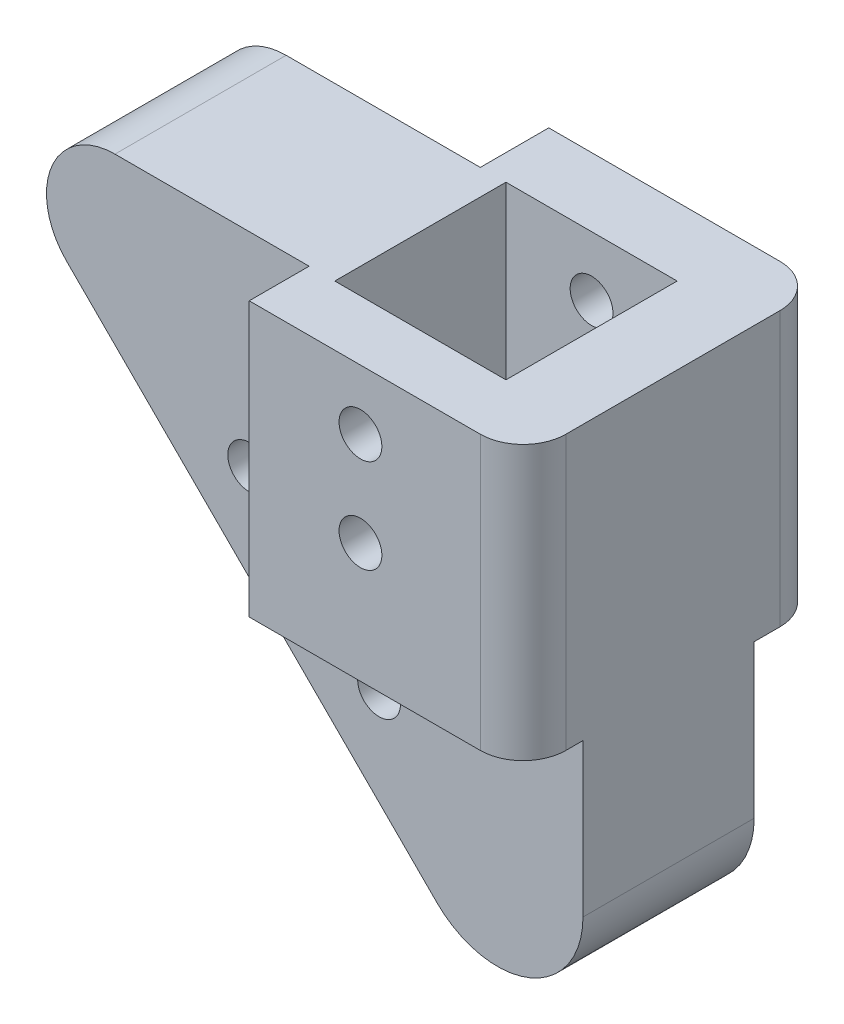
ISO-10303-21;
HEADER;
FILE_DESCRIPTION(('STEP AP214'),'2;1');
FILE_NAME('part.step','',(''),(''),'','','');
FILE_SCHEMA(('AUTOMOTIVE_DESIGN { 1 0 10303 214 1 1 1 1 }'));
ENDSEC;
DATA;
#1=APPLICATION_CONTEXT('core data for automotive mechanical design processes');
#2=APPLICATION_PROTOCOL_DEFINITION('international standard','automotive_design',2000,#1);
#3=PRODUCT_CONTEXT('',#1,'mechanical');
#4=PRODUCT('Part','Part','',(#3));
#5=PRODUCT_RELATED_PRODUCT_CATEGORY('part','',(#4));
#6=PRODUCT_DEFINITION_FORMATION('','',#4);
#7=PRODUCT_DEFINITION_CONTEXT('part definition',#1,'design');
#8=PRODUCT_DEFINITION('design','',#6,#7);
#9=PRODUCT_DEFINITION_SHAPE('','',#8);
#10=(LENGTH_UNIT() NAMED_UNIT(*) SI_UNIT(.MILLI.,.METRE.));
#11=(NAMED_UNIT(*) PLANE_ANGLE_UNIT() SI_UNIT($,.RADIAN.));
#12=(NAMED_UNIT(*) SI_UNIT($,.STERADIAN.) SOLID_ANGLE_UNIT());
#13=UNCERTAINTY_MEASURE_WITH_UNIT(LENGTH_MEASURE(1.E-05),#10,'distance_accuracy_value','');
#14=(GEOMETRIC_REPRESENTATION_CONTEXT(3) GLOBAL_UNCERTAINTY_ASSIGNED_CONTEXT((#13)) GLOBAL_UNIT_ASSIGNED_CONTEXT((#10,
#11,#12)) REPRESENTATION_CONTEXT('',''));
#15=CARTESIAN_POINT('',(0.,0.,0.));
#16=DIRECTION('',(0.,0.,1.));
#17=DIRECTION('',(1.,0.,0.));
#18=AXIS2_PLACEMENT_3D('',#15,#16,#17);
#19=CARTESIAN_POINT('',(0.,0.,0.));
#20=DIRECTION('',(0.,0.,1.));
#21=DIRECTION('',(1.,0.,0.));
#22=AXIS2_PLACEMENT_3D('',#19,#20,#21);
#23=PLANE('',#22);
#24=CARTESIAN_POINT('',(1.37412982933484,-20.8727925216274,0.));
#25=DIRECTION('',(0.,0.,1.));
#26=DIRECTION('',(1.,0.,0.));
#27=AXIS2_PLACEMENT_3D('',#24,#25,#26);
#28=CIRCLE('',#27,2.5);
#29=CARTESIAN_POINT('',(3.87412982933484,-20.8727925216274,0.));
#30=VERTEX_POINT('',#29);
#31=EDGE_CURVE('E431',#30,#30,#28,.T.);
#32=ORIENTED_EDGE('',*,*,#31,.T.);
#33=EDGE_LOOP('',(#32));
#34=FACE_BOUND('',#33,.T.);
#35=CARTESIAN_POINT('',(-13.798157313412,-5.70050537888049,0.));
#36=DIRECTION('',(0.,0.,1.));
#37=DIRECTION('',(1.,0.,0.));
#38=AXIS2_PLACEMENT_3D('',#35,#36,#37);
#39=CIRCLE('',#38,2.5);
#40=CARTESIAN_POINT('',(-11.298157313412,-5.70050537888049,0.));
#41=VERTEX_POINT('',#40);
#42=EDGE_CURVE('E430',#41,#41,#39,.T.);
#43=ORIENTED_EDGE('',*,*,#42,.T.);
#44=EDGE_LOOP('',(#43));
#45=FACE_BOUND('',#44,.T.);
#46=DIRECTION('',(-0.707106781186544,0.707106781186551,0.));
#47=VECTOR('',#46,1.);
#48=CARTESIAN_POINT('',(-15.3354749175199,-15.3354749175198,0.));
#49=LINE('',#48,#47);
#50=CARTESIAN_POINT('',(8.13077487472246,-38.8017247097624,0.));
#51=VERTEX_POINT('',#50);
#52=CARTESIAN_POINT('',(-35.1413030639198,4.4703532288803,0.));
#53=VERTEX_POINT('',#52);
#54=EDGE_CURVE('E252',#51,#53,#49,.T.);
#55=ORIENTED_EDGE('',*,*,#54,.T.);
#56=CARTESIAN_POINT('',(-29.4844488144274,10.1272074783727,0.));
#57=DIRECTION('',(0.,0.,1.));
#58=DIRECTION('',(1.,0.,0.));
#59=AXIS2_PLACEMENT_3D('',#56,#57,#58);
#60=CIRCLE('',#59,8.);
#61=CARTESIAN_POINT('',(-29.4844488144274,18.1272074783727,0.));
#62=VERTEX_POINT('',#61);
#63=EDGE_CURVE('E279',#53,#62,#60,.F.);
#64=ORIENTED_EDGE('',*,*,#63,.T.);
#65=DIRECTION('',(1.,0.,0.));
#66=VECTOR('',#65,1.);
#67=CARTESIAN_POINT('',(0.,18.1272074783727,0.));
#68=LINE('',#67,#66);
#69=CARTESIAN_POINT('',(-6.79815731341203,18.1272074783727,0.));
#70=VERTEX_POINT('',#69);
#71=EDGE_CURVE('E250',#62,#70,#68,.T.);
#72=ORIENTED_EDGE('',*,*,#71,.T.);
#73=DIRECTION('',(0.,1.,0.));
#74=VECTOR('',#73,1.);
#75=CARTESIAN_POINT('',(-6.79815731341203,-13.8727925216274,0.));
#76=LINE('',#75,#74);
#77=CARTESIAN_POINT('',(-6.79815731341203,-13.8727925216274,0.));
#78=VERTEX_POINT('',#77);
#79=EDGE_CURVE('E212',#78,#70,#76,.T.);
#80=ORIENTED_EDGE('',*,*,#79,.F.);
#81=DIRECTION('',(-1.,0.,0.));
#82=VECTOR('',#81,1.);
#83=CARTESIAN_POINT('',(25.201842686588,-13.8727925216274,0.));
#84=LINE('',#83,#82);
#85=CARTESIAN_POINT('',(25.201842686588,-13.8727925216274,0.));
#86=VERTEX_POINT('',#85);
#87=EDGE_CURVE('E180',#86,#78,#84,.T.);
#88=ORIENTED_EDGE('',*,*,#87,.F.);
#89=DIRECTION('',(0.,-1.,0.));
#90=VECTOR('',#89,1.);
#91=CARTESIAN_POINT('',(25.201842686588,0.,0.));
#92=LINE('',#91,#90);
#93=CARTESIAN_POINT('',(25.201842686588,-31.730656897897,0.));
#94=VERTEX_POINT('',#93);
#95=EDGE_CURVE('E229',#86,#94,#92,.T.);
#96=ORIENTED_EDGE('',*,*,#95,.T.);
#97=CARTESIAN_POINT('',(15.201842686588,-31.730656897897,0.));
#98=DIRECTION('',(0.,0.,1.));
#99=DIRECTION('',(1.,0.,0.));
#100=AXIS2_PLACEMENT_3D('',#97,#98,#99);
#101=CIRCLE('',#100,10.);
#102=EDGE_CURVE('E269',#94,#51,#101,.F.);
#103=ORIENTED_EDGE('',*,*,#102,.T.);
#104=EDGE_LOOP('',(#55,#64,#72,#80,#88,#96,#103));
#105=FACE_BOUND('',#104,.T.);
#106=ADVANCED_FACE('F42',(#34,#45,#105),#23,.F.);
#107=CARTESIAN_POINT('',(16.201842686588,0.,20.));
#108=DIRECTION('',(-1.,0.,0.));
#109=DIRECTION('',(0.,0.,1.));
#110=AXIS2_PLACEMENT_3D('',#107,#108,#109);
#111=PLANE('',#110);
#112=DIRECTION('',(0.,1.,0.));
#113=VECTOR('',#112,1.);
#114=CARTESIAN_POINT('',(16.201842686588,0.,0.));
#115=LINE('',#114,#113);
#116=CARTESIAN_POINT('',(16.201842686588,-6.87279252162735,0.));
#117=VERTEX_POINT('',#116);
#118=CARTESIAN_POINT('',(16.201842686588,18.1272074783727,0.));
#119=VERTEX_POINT('',#118);
#120=EDGE_CURVE('E224',#117,#119,#115,.T.);
#121=ORIENTED_EDGE('',*,*,#120,.F.);
#122=DIRECTION('',(0.,0.,-1.));
#123=VECTOR('',#122,1.);
#124=CARTESIAN_POINT('',(16.201842686588,-6.87279252162735,20.));
#125=LINE('',#124,#123);
#126=CARTESIAN_POINT('',(16.201842686588,-6.87279252162735,20.));
#127=VERTEX_POINT('',#126);
#128=EDGE_CURVE('E264',#127,#117,#125,.T.);
#129=ORIENTED_EDGE('',*,*,#128,.F.);
#130=DIRECTION('',(0.,1.,0.));
#131=VECTOR('',#130,1.);
#132=CARTESIAN_POINT('',(16.201842686588,0.,20.));
#133=LINE('',#132,#131);
#134=CARTESIAN_POINT('',(16.201842686588,18.1272074783727,20.));
#135=VERTEX_POINT('',#134);
#136=EDGE_CURVE('E225',#127,#135,#133,.T.);
#137=ORIENTED_EDGE('',*,*,#136,.T.);
#138=DIRECTION('',(0.,0.,-1.));
#139=VECTOR('',#138,1.);
#140=CARTESIAN_POINT('',(16.201842686588,18.1272074783727,20.));
#141=LINE('',#140,#139);
#142=EDGE_CURVE('E241',#135,#119,#141,.T.);
#143=ORIENTED_EDGE('',*,*,#142,.T.);
#144=EDGE_LOOP('',(#121,#129,#137,#143));
#145=FACE_BOUND('',#144,.T.);
#146=ADVANCED_FACE('F354',(#145),#111,.T.);
#147=CARTESIAN_POINT('',(0.,-6.87279252162735,20.));
#148=DIRECTION('',(0.,1.,0.));
#149=DIRECTION('',(0.,0.,1.));
#150=AXIS2_PLACEMENT_3D('',#147,#148,#149);
#151=PLANE('',#150);
#152=DIRECTION('',(1.,0.,0.));
#153=VECTOR('',#152,1.);
#154=CARTESIAN_POINT('',(0.,-6.87279252162735,0.));
#155=LINE('',#154,#153);
#156=CARTESIAN_POINT('',(-3.79815731341203,-6.87279252162735,0.));
#157=VERTEX_POINT('',#156);
#158=EDGE_CURVE('E244',#157,#117,#155,.T.);
#159=ORIENTED_EDGE('',*,*,#158,.F.);
#160=DIRECTION('',(0.,0.,-1.));
#161=VECTOR('',#160,1.);
#162=CARTESIAN_POINT('',(-3.79815731341203,-6.87279252162735,20.));
#163=LINE('',#162,#161);
#164=CARTESIAN_POINT('',(-3.79815731341203,-6.87279252162735,20.));
#165=VERTEX_POINT('',#164);
#166=EDGE_CURVE('E262',#165,#157,#163,.T.);
#167=ORIENTED_EDGE('',*,*,#166,.F.);
#168=DIRECTION('',(1.,0.,0.));
#169=VECTOR('',#168,1.);
#170=CARTESIAN_POINT('',(0.,-6.87279252162735,20.));
#171=LINE('',#170,#169);
#172=EDGE_CURVE('E228',#165,#127,#171,.T.);
#173=ORIENTED_EDGE('',*,*,#172,.T.);
#174=ORIENTED_EDGE('',*,*,#128,.T.);
#175=EDGE_LOOP('',(#159,#167,#173,#174));
#176=FACE_BOUND('',#175,.T.);
#177=ADVANCED_FACE('F360',(#176),#151,.T.);
#178=CARTESIAN_POINT('',(-3.79815731341203,0.,20.));
#179=DIRECTION('',(1.,0.,0.));
#180=DIRECTION('',(0.,0.,-1.));
#181=AXIS2_PLACEMENT_3D('',#178,#179,#180);
#182=PLANE('',#181);
#183=DIRECTION('',(0.,-1.,0.));
#184=VECTOR('',#183,1.);
#185=CARTESIAN_POINT('',(-3.79815731341203,0.,0.));
#186=LINE('',#185,#184);
#187=CARTESIAN_POINT('',(-3.79815731341203,18.1272074783727,0.));
#188=VERTEX_POINT('',#187);
#189=EDGE_CURVE('E247',#188,#157,#186,.T.);
#190=ORIENTED_EDGE('',*,*,#189,.F.);
#191=DIRECTION('',(0.,0.,-1.));
#192=VECTOR('',#191,1.);
#193=CARTESIAN_POINT('',(-3.79815731341203,18.1272074783727,20.));
#194=LINE('',#193,#192);
#195=CARTESIAN_POINT('',(-3.79815731341203,18.1272074783727,20.));
#196=VERTEX_POINT('',#195);
#197=EDGE_CURVE('E260',#196,#188,#194,.T.);
#198=ORIENTED_EDGE('',*,*,#197,.F.);
#199=DIRECTION('',(0.,-1.,0.));
#200=VECTOR('',#199,1.);
#201=CARTESIAN_POINT('',(-3.79815731341203,0.,20.));
#202=LINE('',#201,#200);
#203=EDGE_CURVE('E232',#196,#165,#202,.T.);
#204=ORIENTED_EDGE('',*,*,#203,.T.);
#205=ORIENTED_EDGE('',*,*,#166,.T.);
#206=EDGE_LOOP('',(#190,#198,#204,#205));
#207=FACE_BOUND('',#206,.T.);
#208=ADVANCED_FACE('F374',(#207),#182,.T.);
#209=CARTESIAN_POINT('',(-15.3354749175199,-15.3354749175198,20.));
#210=DIRECTION('',(-0.707106781186551,-0.707106781186544,0.));
#211=DIRECTION('',(0.707106781186544,-0.707106781186551,0.));
#212=AXIS2_PLACEMENT_3D('',#209,#210,#211);
#213=PLANE('',#212);
#214=DIRECTION('',(-0.707106781186544,0.707106781186551,0.));
#215=VECTOR('',#214,1.);
#216=CARTESIAN_POINT('',(-15.3354749175199,-15.3354749175198,20.));
#217=LINE('',#216,#215);
#218=CARTESIAN_POINT('',(8.13077487472246,-38.8017247097624,20.));
#219=VERTEX_POINT('',#218);
#220=CARTESIAN_POINT('',(-35.1413030639198,4.4703532288803,20.));
#221=VERTEX_POINT('',#220);
#222=EDGE_CURVE('E236',#219,#221,#217,.T.);
#223=ORIENTED_EDGE('',*,*,#222,.T.);
#224=DIRECTION('',(0.,0.,-1.));
#225=VECTOR('',#224,1.);
#226=CARTESIAN_POINT('',(-35.1413030639198,4.4703532288803,20.));
#227=LINE('',#226,#225);
#228=EDGE_CURVE('E276',#221,#53,#227,.T.);
#229=ORIENTED_EDGE('',*,*,#228,.T.);
#230=ORIENTED_EDGE('',*,*,#54,.F.);
#231=DIRECTION('',(0.,0.,-1.));
#232=VECTOR('',#231,1.);
#233=CARTESIAN_POINT('',(8.13077487472246,-38.8017247097624,20.));
#234=LINE('',#233,#232);
#235=EDGE_CURVE('E271',#51,#219,#234,.F.);
#236=ORIENTED_EDGE('',*,*,#235,.T.);
#237=EDGE_LOOP('',(#223,#229,#230,#236));
#238=FACE_BOUND('',#237,.T.);
#239=ADVANCED_FACE('F342',(#238),#213,.T.);
#240=CARTESIAN_POINT('',(25.201842686588,0.,20.));
#241=DIRECTION('',(1.,0.,0.));
#242=DIRECTION('',(0.,1.,0.));
#243=AXIS2_PLACEMENT_3D('',#240,#241,#242);
#244=PLANE('',#243);
#245=DIRECTION('',(0.,0.,1.));
#246=VECTOR('',#245,1.);
#247=CARTESIAN_POINT('',(25.201842686588,-13.8727925216274,-8.));
#248=LINE('',#247,#246);
#249=CARTESIAN_POINT('',(25.201842686588,-13.8727925216274,-3.));
#250=VERTEX_POINT('',#249);
#251=EDGE_CURVE('E222',#250,#86,#248,.T.);
#252=ORIENTED_EDGE('',*,*,#251,.F.);
#253=DIRECTION('',(0.,-1.,0.));
#254=VECTOR('',#253,1.);
#255=CARTESIAN_POINT('',(25.201842686588,18.1272074783726,-3.));
#256=LINE('',#255,#254);
#257=CARTESIAN_POINT('',(25.201842686588,18.1272074783727,-3.));
#258=VERTEX_POINT('',#257);
#259=EDGE_CURVE('E302',#250,#258,#256,.F.);
#260=ORIENTED_EDGE('',*,*,#259,.T.);
#261=DIRECTION('',(0.,0.,-1.));
#262=VECTOR('',#261,1.);
#263=CARTESIAN_POINT('',(25.201842686588,18.1272074783727,20.));
#264=LINE('',#263,#262);
#265=CARTESIAN_POINT('',(25.201842686588,18.1272074783727,22.));
#266=VERTEX_POINT('',#265);
#267=EDGE_CURVE('E258',#266,#258,#264,.T.);
#268=ORIENTED_EDGE('',*,*,#267,.F.);
#269=DIRECTION('',(0.,1.,0.));
#270=VECTOR('',#269,1.);
#271=CARTESIAN_POINT('',(25.201842686588,-13.8727925216274,22.));
#272=LINE('',#271,#270);
#273=CARTESIAN_POINT('',(25.201842686588,-13.8727925216274,22.));
#274=VERTEX_POINT('',#273);
#275=EDGE_CURVE('E300',#266,#274,#272,.F.);
#276=ORIENTED_EDGE('',*,*,#275,.T.);
#277=DIRECTION('',(0.,0.,-1.));
#278=VECTOR('',#277,1.);
#279=CARTESIAN_POINT('',(25.201842686588,-13.8727925216274,27.));
#280=LINE('',#279,#278);
#281=CARTESIAN_POINT('',(25.201842686588,-13.8727925216274,20.));
#282=VERTEX_POINT('',#281);
#283=EDGE_CURVE('E187',#274,#282,#280,.T.);
#284=ORIENTED_EDGE('',*,*,#283,.T.);
#285=DIRECTION('',(0.,-1.,0.));
#286=VECTOR('',#285,1.);
#287=CARTESIAN_POINT('',(25.201842686588,0.,20.));
#288=LINE('',#287,#286);
#289=CARTESIAN_POINT('',(25.201842686588,-31.730656897897,20.));
#290=VERTEX_POINT('',#289);
#291=EDGE_CURVE('E239',#282,#290,#288,.T.);
#292=ORIENTED_EDGE('',*,*,#291,.T.);
#293=DIRECTION('',(0.,0.,-1.));
#294=VECTOR('',#293,1.);
#295=CARTESIAN_POINT('',(25.201842686588,-31.730656897897,20.));
#296=LINE('',#295,#294);
#297=EDGE_CURVE('E266',#290,#94,#296,.T.);
#298=ORIENTED_EDGE('',*,*,#297,.T.);
#299=ORIENTED_EDGE('',*,*,#95,.F.);
#300=EDGE_LOOP('',(#252,#260,#268,#276,#284,#292,#298,#299));
#301=FACE_BOUND('',#300,.T.);
#302=ADVANCED_FACE('F325',(#301),#244,.T.);
#303=CARTESIAN_POINT('',(0.,18.1272074783727,20.));
#304=DIRECTION('',(0.,1.,0.));
#305=DIRECTION('',(0.,0.,1.));
#306=AXIS2_PLACEMENT_3D('',#303,#304,#305);
#307=PLANE('',#306);
#308=ORIENTED_EDGE('',*,*,#267,.T.);
#309=CARTESIAN_POINT('',(20.201842686588,18.1272074783727,-3.));
#310=DIRECTION('',(0.,1.,0.));
#311=DIRECTION('',(0.,0.,1.));
#312=AXIS2_PLACEMENT_3D('',#309,#310,#311);
#313=CIRCLE('',#312,5.);
#314=CARTESIAN_POINT('',(20.201842686588,18.1272074783726,-8.));
#315=VERTEX_POINT('',#314);
#316=EDGE_CURVE('E305',#258,#315,#313,.T.);
#317=ORIENTED_EDGE('',*,*,#316,.T.);
#318=DIRECTION('',(1.,0.,0.));
#319=VECTOR('',#318,1.);
#320=CARTESIAN_POINT('',(25.201842686588,18.1272074783726,-8.));
#321=LINE('',#320,#319);
#322=CARTESIAN_POINT('',(-6.79815731341203,18.1272074783726,-8.));
#323=VERTEX_POINT('',#322);
#324=EDGE_CURVE('E206',#323,#315,#321,.T.);
#325=ORIENTED_EDGE('',*,*,#324,.F.);
#326=DIRECTION('',(0.,0.,1.));
#327=VECTOR('',#326,1.);
#328=CARTESIAN_POINT('',(-6.79815731341203,18.1272074783726,-8.));
#329=LINE('',#328,#327);
#330=EDGE_CURVE('E209',#323,#70,#329,.T.);
#331=ORIENTED_EDGE('',*,*,#330,.T.);
#332=ORIENTED_EDGE('',*,*,#71,.F.);
#333=DIRECTION('',(0.,0.,-1.));
#334=VECTOR('',#333,1.);
#335=CARTESIAN_POINT('',(-29.4844488144274,18.1272074783727,20.));
#336=LINE('',#335,#334);
#337=CARTESIAN_POINT('',(-29.4844488144274,18.1272074783727,20.));
#338=VERTEX_POINT('',#337);
#339=EDGE_CURVE('E281',#62,#338,#336,.F.);
#340=ORIENTED_EDGE('',*,*,#339,.T.);
#341=DIRECTION('',(1.,0.,0.));
#342=VECTOR('',#341,1.);
#343=CARTESIAN_POINT('',(0.,18.1272074783727,20.));
#344=LINE('',#343,#342);
#345=CARTESIAN_POINT('',(-6.79815731341203,18.1272074783727,20.));
#346=VERTEX_POINT('',#345);
#347=EDGE_CURVE('E176',#338,#346,#344,.T.);
#348=ORIENTED_EDGE('',*,*,#347,.T.);
#349=DIRECTION('',(0.,0.,-1.));
#350=VECTOR('',#349,1.);
#351=CARTESIAN_POINT('',(-6.79815731341203,18.1272074783726,27.));
#352=LINE('',#351,#350);
#353=CARTESIAN_POINT('',(-6.79815731341203,18.1272074783726,27.));
#354=VERTEX_POINT('',#353);
#355=EDGE_CURVE('E171',#354,#346,#352,.T.);
#356=ORIENTED_EDGE('',*,*,#355,.F.);
#357=DIRECTION('',(-1.,0.,0.));
#358=VECTOR('',#357,1.);
#359=CARTESIAN_POINT('',(25.201842686588,18.1272074783727,27.));
#360=LINE('',#359,#358);
#361=CARTESIAN_POINT('',(20.201842686588,18.1272074783727,27.));
#362=VERTEX_POINT('',#361);
#363=EDGE_CURVE('E161',#362,#354,#360,.T.);
#364=ORIENTED_EDGE('',*,*,#363,.F.);
#365=CARTESIAN_POINT('',(20.201842686588,18.1272074783727,22.));
#366=DIRECTION('',(0.,1.,0.));
#367=DIRECTION('',(0.,0.,1.));
#368=AXIS2_PLACEMENT_3D('',#365,#366,#367);
#369=CIRCLE('',#368,5.);
#370=EDGE_CURVE('E63',#362,#266,#369,.T.);
#371=ORIENTED_EDGE('',*,*,#370,.T.);
#372=EDGE_LOOP('',(#308,#317,#325,#331,#332,#340,#348,#356,#364,#371));
#373=FACE_BOUND('',#372,.T.);
#374=ORIENTED_EDGE('',*,*,#142,.F.);
#375=DIRECTION('',(-1.,0.,0.));
#376=VECTOR('',#375,1.);
#377=CARTESIAN_POINT('',(25.201842686588,18.1272074783727,20.));
#378=LINE('',#377,#376);
#379=EDGE_CURVE('E191',#135,#196,#378,.T.);
#380=ORIENTED_EDGE('',*,*,#379,.T.);
#381=ORIENTED_EDGE('',*,*,#197,.T.);
#382=DIRECTION('',(1.,0.,0.));
#383=VECTOR('',#382,1.);
#384=CARTESIAN_POINT('',(25.201842686588,18.1272074783726,0.));
#385=LINE('',#384,#383);
#386=EDGE_CURVE('E204',#188,#119,#385,.T.);
#387=ORIENTED_EDGE('',*,*,#386,.T.);
#388=EDGE_LOOP('',(#374,#380,#381,#387));
#389=FACE_BOUND('',#388,.T.);
#390=ADVANCED_FACE('F173',(#373,#389),#307,.T.);
#391=CARTESIAN_POINT('',(0.,0.,20.));
#392=DIRECTION('',(0.,0.,1.));
#393=DIRECTION('',(1.,0.,0.));
#394=AXIS2_PLACEMENT_3D('',#391,#392,#393);
#395=PLANE('',#394);
#396=CARTESIAN_POINT('',(1.37412982933484,-20.8727925216274,20.));
#397=DIRECTION('',(0.,0.,1.));
#398=DIRECTION('',(1.,0.,0.));
#399=AXIS2_PLACEMENT_3D('',#396,#397,#398);
#400=CIRCLE('',#399,2.5);
#401=CARTESIAN_POINT('',(3.87412982933484,-20.8727925216274,20.));
#402=VERTEX_POINT('',#401);
#403=EDGE_CURVE('E425',#402,#402,#400,.T.);
#404=ORIENTED_EDGE('',*,*,#403,.F.);
#405=EDGE_LOOP('',(#404));
#406=FACE_BOUND('',#405,.T.);
#407=CARTESIAN_POINT('',(-13.798157313412,-5.70050537888049,20.));
#408=DIRECTION('',(0.,0.,1.));
#409=DIRECTION('',(1.,0.,0.));
#410=AXIS2_PLACEMENT_3D('',#407,#408,#409);
#411=CIRCLE('',#410,2.5);
#412=CARTESIAN_POINT('',(-11.298157313412,-5.70050537888049,20.));
#413=VERTEX_POINT('',#412);
#414=EDGE_CURVE('E428',#413,#413,#411,.T.);
#415=ORIENTED_EDGE('',*,*,#414,.F.);
#416=EDGE_LOOP('',(#415));
#417=FACE_BOUND('',#416,.T.);
#418=ORIENTED_EDGE('',*,*,#347,.F.);
#419=CARTESIAN_POINT('',(-29.4844488144274,10.1272074783727,20.));
#420=DIRECTION('',(0.,0.,1.));
#421=DIRECTION('',(1.,0.,0.));
#422=AXIS2_PLACEMENT_3D('',#419,#420,#421);
#423=CIRCLE('',#422,8.);
#424=EDGE_CURVE('E283',#338,#221,#423,.T.);
#425=ORIENTED_EDGE('',*,*,#424,.T.);
#426=ORIENTED_EDGE('',*,*,#222,.F.);
#427=CARTESIAN_POINT('',(15.201842686588,-31.730656897897,20.));
#428=DIRECTION('',(0.,0.,1.));
#429=DIRECTION('',(1.,0.,0.));
#430=AXIS2_PLACEMENT_3D('',#427,#428,#429);
#431=CIRCLE('',#430,10.);
#432=EDGE_CURVE('E273',#219,#290,#431,.T.);
#433=ORIENTED_EDGE('',*,*,#432,.T.);
#434=ORIENTED_EDGE('',*,*,#291,.F.);
#435=DIRECTION('',(1.,0.,0.));
#436=VECTOR('',#435,1.);
#437=CARTESIAN_POINT('',(25.201842686588,-13.8727925216274,20.));
#438=LINE('',#437,#436);
#439=CARTESIAN_POINT('',(-6.79815731341203,-13.8727925216274,20.));
#440=VERTEX_POINT('',#439);
#441=EDGE_CURVE('E168',#440,#282,#438,.T.);
#442=ORIENTED_EDGE('',*,*,#441,.F.);
#443=DIRECTION('',(0.,-1.,0.));
#444=VECTOR('',#443,1.);
#445=CARTESIAN_POINT('',(-6.79815731341203,18.1272074783726,20.));
#446=LINE('',#445,#444);
#447=EDGE_CURVE('E194',#346,#440,#446,.T.);
#448=ORIENTED_EDGE('',*,*,#447,.F.);
#449=EDGE_LOOP('',(#418,#425,#426,#433,#434,#442,#448));
#450=FACE_BOUND('',#449,.T.);
#451=ADVANCED_FACE('F339',(#406,#417,#450),#395,.T.);
#452=CARTESIAN_POINT('',(25.201842686588,-13.8727925216274,-8.));
#453=DIRECTION('',(0.,1.,0.));
#454=DIRECTION('',(0.,0.,1.));
#455=AXIS2_PLACEMENT_3D('',#452,#453,#454);
#456=PLANE('',#455);
#457=DIRECTION('',(-1.,0.,0.));
#458=VECTOR('',#457,1.);
#459=CARTESIAN_POINT('',(25.201842686588,-13.8727925216274,-8.));
#460=LINE('',#459,#458);
#461=CARTESIAN_POINT('',(20.201842686588,-13.8727925216274,-8.));
#462=VERTEX_POINT('',#461);
#463=CARTESIAN_POINT('',(-6.79815731341203,-13.8727925216274,-8.));
#464=VERTEX_POINT('',#463);
#465=EDGE_CURVE('E201',#462,#464,#460,.T.);
#466=ORIENTED_EDGE('',*,*,#465,.F.);
#467=CARTESIAN_POINT('',(20.201842686588,-13.8727925216274,-3.));
#468=DIRECTION('',(0.,1.,0.));
#469=DIRECTION('',(0.,0.,1.));
#470=AXIS2_PLACEMENT_3D('',#467,#468,#469);
#471=CIRCLE('',#470,5.);
#472=EDGE_CURVE('E298',#462,#250,#471,.F.);
#473=ORIENTED_EDGE('',*,*,#472,.T.);
#474=ORIENTED_EDGE('',*,*,#251,.T.);
#475=ORIENTED_EDGE('',*,*,#87,.T.);
#476=DIRECTION('',(0.,0.,1.));
#477=VECTOR('',#476,1.);
#478=CARTESIAN_POINT('',(-6.79815731341203,-13.8727925216274,-8.));
#479=LINE('',#478,#477);
#480=EDGE_CURVE('E219',#464,#78,#479,.T.);
#481=ORIENTED_EDGE('',*,*,#480,.F.);
#482=EDGE_LOOP('',(#466,#473,#474,#475,#481));
#483=FACE_BOUND('',#482,.T.);
#484=ADVANCED_FACE('F320',(#483),#456,.F.);
#485=CARTESIAN_POINT('',(-6.79815731341203,-13.8727925216274,-8.));
#486=DIRECTION('',(1.,0.,0.));
#487=DIRECTION('',(0.,0.,-1.));
#488=AXIS2_PLACEMENT_3D('',#485,#486,#487);
#489=PLANE('',#488);
#490=ORIENTED_EDGE('',*,*,#79,.T.);
#491=ORIENTED_EDGE('',*,*,#330,.F.);
#492=DIRECTION('',(0.,1.,0.));
#493=VECTOR('',#492,1.);
#494=CARTESIAN_POINT('',(-6.79815731341203,-13.8727925216274,-8.));
#495=LINE('',#494,#493);
#496=EDGE_CURVE('E203',#464,#323,#495,.T.);
#497=ORIENTED_EDGE('',*,*,#496,.F.);
#498=ORIENTED_EDGE('',*,*,#480,.T.);
#499=EDGE_LOOP('',(#490,#491,#497,#498));
#500=FACE_BOUND('',#499,.T.);
#501=ADVANCED_FACE('F330',(#500),#489,.F.);
#502=CARTESIAN_POINT('',(0.,0.,-8.));
#503=DIRECTION('',(0.,0.,1.));
#504=DIRECTION('',(1.,0.,0.));
#505=AXIS2_PLACEMENT_3D('',#502,#503,#504);
#506=PLANE('',#505);
#507=CARTESIAN_POINT('',(6.20184268658797,11.1272074783727,-8.));
#508=DIRECTION('',(0.,0.,-1.));
#509=DIRECTION('',(-1.,0.,0.));
#510=AXIS2_PLACEMENT_3D('',#507,#508,#509);
#511=CIRCLE('',#510,2.5);
#512=CARTESIAN_POINT('',(3.70184268658797,11.1272074783727,-8.));
#513=VERTEX_POINT('',#512);
#514=EDGE_CURVE('E295',#513,#513,#511,.T.);
#515=ORIENTED_EDGE('',*,*,#514,.F.);
#516=EDGE_LOOP('',(#515));
#517=FACE_BOUND('',#516,.T.);
#518=CARTESIAN_POINT('',(6.20184268658797,0.127207478372648,-8.));
#519=DIRECTION('',(0.,0.,-1.));
#520=DIRECTION('',(-1.,0.,0.));
#521=AXIS2_PLACEMENT_3D('',#518,#519,#520);
#522=CIRCLE('',#521,2.5);
#523=CARTESIAN_POINT('',(3.70184268658797,0.127207478372648,-8.));
#524=VERTEX_POINT('',#523);
#525=EDGE_CURVE('E290',#524,#524,#522,.T.);
#526=ORIENTED_EDGE('',*,*,#525,.F.);
#527=EDGE_LOOP('',(#526));
#528=FACE_BOUND('',#527,.T.);
#529=ORIENTED_EDGE('',*,*,#324,.T.);
#530=DIRECTION('',(0.,-1.,0.));
#531=VECTOR('',#530,1.);
#532=CARTESIAN_POINT('',(20.201842686588,-13.8727925216274,-8.));
#533=LINE('',#532,#531);
#534=EDGE_CURVE('E285',#315,#462,#533,.T.);
#535=ORIENTED_EDGE('',*,*,#534,.T.);
#536=ORIENTED_EDGE('',*,*,#465,.T.);
#537=ORIENTED_EDGE('',*,*,#496,.T.);
#538=EDGE_LOOP('',(#529,#535,#536,#537));
#539=FACE_BOUND('',#538,.T.);
#540=ADVANCED_FACE('F313',(#517,#528,#539),#506,.F.);
#541=CARTESIAN_POINT('',(0.,0.,0.));
#542=DIRECTION('',(0.,0.,1.));
#543=DIRECTION('',(1.,0.,0.));
#544=AXIS2_PLACEMENT_3D('',#541,#542,#543);
#545=PLANE('',#544);
#546=CARTESIAN_POINT('',(6.20184268658797,11.1272074783727,0.));
#547=DIRECTION('',(0.,0.,1.));
#548=DIRECTION('',(1.,0.,0.));
#549=AXIS2_PLACEMENT_3D('',#546,#547,#548);
#550=CIRCLE('',#549,2.5);
#551=CARTESIAN_POINT('',(8.70184268658797,11.1272074783727,0.));
#552=VERTEX_POINT('',#551);
#553=EDGE_CURVE('E442',#552,#552,#550,.T.);
#554=ORIENTED_EDGE('',*,*,#553,.F.);
#555=EDGE_LOOP('',(#554));
#556=FACE_BOUND('',#555,.T.);
#557=CARTESIAN_POINT('',(6.20184268658797,0.127207478372648,0.));
#558=DIRECTION('',(0.,0.,1.));
#559=DIRECTION('',(1.,0.,0.));
#560=AXIS2_PLACEMENT_3D('',#557,#558,#559);
#561=CIRCLE('',#560,2.5);
#562=CARTESIAN_POINT('',(8.70184268658797,0.127207478372648,0.));
#563=VERTEX_POINT('',#562);
#564=EDGE_CURVE('E195',#563,#563,#561,.T.);
#565=ORIENTED_EDGE('',*,*,#564,.F.);
#566=EDGE_LOOP('',(#565));
#567=FACE_BOUND('',#566,.T.);
#568=ORIENTED_EDGE('',*,*,#158,.T.);
#569=ORIENTED_EDGE('',*,*,#120,.T.);
#570=ORIENTED_EDGE('',*,*,#386,.F.);
#571=ORIENTED_EDGE('',*,*,#189,.T.);
#572=EDGE_LOOP('',(#568,#569,#570,#571));
#573=FACE_BOUND('',#572,.T.);
#574=ADVANCED_FACE('F384',(#556,#567,#573),#545,.T.);
#575=CARTESIAN_POINT('',(15.201842686588,-31.730656897897,20.));
#576=DIRECTION('',(0.,0.,-1.));
#577=DIRECTION('',(-1.,0.,0.));
#578=AXIS2_PLACEMENT_3D('',#575,#576,#577);
#579=CYLINDRICAL_SURFACE('',#578,10.);
#580=ORIENTED_EDGE('',*,*,#432,.F.);
#581=ORIENTED_EDGE('',*,*,#235,.F.);
#582=ORIENTED_EDGE('',*,*,#102,.F.);
#583=ORIENTED_EDGE('',*,*,#297,.F.);
#584=EDGE_LOOP('',(#580,#581,#582,#583));
#585=FACE_BOUND('',#584,.T.);
#586=ADVANCED_FACE('F345',(#585),#579,.T.);
#587=CARTESIAN_POINT('',(0.,0.,20.));
#588=DIRECTION('',(0.,0.,-1.));
#589=DIRECTION('',(-1.,0.,0.));
#590=AXIS2_PLACEMENT_3D('',#587,#588,#589);
#591=PLANE('',#590);
#592=CARTESIAN_POINT('',(6.20184268658797,11.1272074783727,20.));
#593=DIRECTION('',(0.,0.,-1.));
#594=DIRECTION('',(-1.,0.,0.));
#595=AXIS2_PLACEMENT_3D('',#592,#593,#594);
#596=CIRCLE('',#595,2.5);
#597=CARTESIAN_POINT('',(3.70184268658797,11.1272074783727,20.));
#598=VERTEX_POINT('',#597);
#599=EDGE_CURVE('E294',#598,#598,#596,.T.);
#600=ORIENTED_EDGE('',*,*,#599,.F.);
#601=EDGE_LOOP('',(#600));
#602=FACE_BOUND('',#601,.T.);
#603=CARTESIAN_POINT('',(6.20184268658797,0.127207478372648,20.));
#604=DIRECTION('',(0.,0.,-1.));
#605=DIRECTION('',(-1.,0.,0.));
#606=AXIS2_PLACEMENT_3D('',#603,#604,#605);
#607=CIRCLE('',#606,2.5);
#608=CARTESIAN_POINT('',(3.70184268658797,0.127207478372648,20.));
#609=VERTEX_POINT('',#608);
#610=EDGE_CURVE('E289',#609,#609,#607,.T.);
#611=ORIENTED_EDGE('',*,*,#610,.F.);
#612=EDGE_LOOP('',(#611));
#613=FACE_BOUND('',#612,.T.);
#614=ORIENTED_EDGE('',*,*,#136,.F.);
#615=ORIENTED_EDGE('',*,*,#172,.F.);
#616=ORIENTED_EDGE('',*,*,#203,.F.);
#617=ORIENTED_EDGE('',*,*,#379,.F.);
#618=EDGE_LOOP('',(#614,#615,#616,#617));
#619=FACE_BOUND('',#618,.T.);
#620=ADVANCED_FACE('F383',(#602,#613,#619),#591,.T.);
#621=CARTESIAN_POINT('',(-6.79815731341203,18.1272074783726,27.));
#622=DIRECTION('',(1.,0.,0.));
#623=DIRECTION('',(0.,1.,0.));
#624=AXIS2_PLACEMENT_3D('',#621,#622,#623);
#625=PLANE('',#624);
#626=ORIENTED_EDGE('',*,*,#447,.T.);
#627=DIRECTION('',(0.,0.,-1.));
#628=VECTOR('',#627,1.);
#629=CARTESIAN_POINT('',(-6.79815731341203,-13.8727925216274,27.));
#630=LINE('',#629,#628);
#631=CARTESIAN_POINT('',(-6.79815731341203,-13.8727925216274,27.));
#632=VERTEX_POINT('',#631);
#633=EDGE_CURVE('E181',#632,#440,#630,.T.);
#634=ORIENTED_EDGE('',*,*,#633,.F.);
#635=DIRECTION('',(0.,-1.,0.));
#636=VECTOR('',#635,1.);
#637=CARTESIAN_POINT('',(-6.79815731341203,18.1272074783726,27.));
#638=LINE('',#637,#636);
#639=EDGE_CURVE('E165',#354,#632,#638,.T.);
#640=ORIENTED_EDGE('',*,*,#639,.F.);
#641=ORIENTED_EDGE('',*,*,#355,.T.);
#642=EDGE_LOOP('',(#626,#634,#640,#641));
#643=FACE_BOUND('',#642,.T.);
#644=ADVANCED_FACE('F183',(#643),#625,.F.);
#645=CARTESIAN_POINT('',(25.201842686588,-13.8727925216274,27.));
#646=DIRECTION('',(0.,1.,0.));
#647=DIRECTION('',(-1.,0.,0.));
#648=AXIS2_PLACEMENT_3D('',#645,#646,#647);
#649=PLANE('',#648);
#650=ORIENTED_EDGE('',*,*,#283,.F.);
#651=CARTESIAN_POINT('',(20.201842686588,-13.8727925216274,22.));
#652=DIRECTION('',(0.,1.,0.));
#653=DIRECTION('',(-1.,0.,0.));
#654=AXIS2_PLACEMENT_3D('',#651,#652,#653);
#655=CIRCLE('',#654,5.);
#656=CARTESIAN_POINT('',(20.201842686588,-13.8727925216274,27.));
#657=VERTEX_POINT('',#656);
#658=EDGE_CURVE('E11',#274,#657,#655,.F.);
#659=ORIENTED_EDGE('',*,*,#658,.T.);
#660=DIRECTION('',(1.,0.,0.));
#661=VECTOR('',#660,1.);
#662=CARTESIAN_POINT('',(25.201842686588,-13.8727925216274,27.));
#663=LINE('',#662,#661);
#664=EDGE_CURVE('E185',#632,#657,#663,.T.);
#665=ORIENTED_EDGE('',*,*,#664,.F.);
#666=ORIENTED_EDGE('',*,*,#633,.T.);
#667=ORIENTED_EDGE('',*,*,#441,.T.);
#668=EDGE_LOOP('',(#650,#659,#665,#666,#667));
#669=FACE_BOUND('',#668,.T.);
#670=ADVANCED_FACE('F347',(#669),#649,.F.);
#671=CARTESIAN_POINT('',(0.,0.,27.));
#672=DIRECTION('',(0.,0.,-1.));
#673=DIRECTION('',(-1.,0.,0.));
#674=AXIS2_PLACEMENT_3D('',#671,#672,#673);
#675=PLANE('',#674);
#676=CARTESIAN_POINT('',(6.20184268658797,11.1272074783727,27.));
#677=DIRECTION('',(0.,0.,-1.));
#678=DIRECTION('',(-1.,0.,0.));
#679=AXIS2_PLACEMENT_3D('',#676,#677,#678);
#680=CIRCLE('',#679,2.5);
#681=CARTESIAN_POINT('',(3.70184268658797,11.1272074783727,27.));
#682=VERTEX_POINT('',#681);
#683=EDGE_CURVE('E291',#682,#682,#680,.T.);
#684=ORIENTED_EDGE('',*,*,#683,.T.);
#685=EDGE_LOOP('',(#684));
#686=FACE_BOUND('',#685,.T.);
#687=CARTESIAN_POINT('',(6.20184268658797,0.127207478372648,27.));
#688=DIRECTION('',(0.,0.,-1.));
#689=DIRECTION('',(-1.,0.,0.));
#690=AXIS2_PLACEMENT_3D('',#687,#688,#689);
#691=CIRCLE('',#690,2.5);
#692=CARTESIAN_POINT('',(3.70184268658797,0.127207478372648,27.));
#693=VERTEX_POINT('',#692);
#694=EDGE_CURVE('E286',#693,#693,#691,.T.);
#695=ORIENTED_EDGE('',*,*,#694,.T.);
#696=EDGE_LOOP('',(#695));
#697=FACE_BOUND('',#696,.T.);
#698=ORIENTED_EDGE('',*,*,#664,.T.);
#699=DIRECTION('',(0.,1.,0.));
#700=VECTOR('',#699,1.);
#701=CARTESIAN_POINT('',(20.201842686588,18.1272074783727,27.));
#702=LINE('',#701,#700);
#703=EDGE_CURVE('E50',#657,#362,#702,.T.);
#704=ORIENTED_EDGE('',*,*,#703,.T.);
#705=ORIENTED_EDGE('',*,*,#363,.T.);
#706=ORIENTED_EDGE('',*,*,#639,.T.);
#707=EDGE_LOOP('',(#698,#704,#705,#706));
#708=FACE_BOUND('',#707,.T.);
#709=ADVANCED_FACE('F163',(#686,#697,#708),#675,.F.);
#710=CARTESIAN_POINT('',(-29.4844488144274,10.1272074783727,20.));
#711=DIRECTION('',(0.,0.,-1.));
#712=DIRECTION('',(-1.,0.,0.));
#713=AXIS2_PLACEMENT_3D('',#710,#711,#712);
#714=CYLINDRICAL_SURFACE('',#713,8.);
#715=ORIENTED_EDGE('',*,*,#424,.F.);
#716=ORIENTED_EDGE('',*,*,#339,.F.);
#717=ORIENTED_EDGE('',*,*,#63,.F.);
#718=ORIENTED_EDGE('',*,*,#228,.F.);
#719=EDGE_LOOP('',(#715,#716,#717,#718));
#720=FACE_BOUND('',#719,.T.);
#721=ADVANCED_FACE('F335',(#720),#714,.T.);
#722=CARTESIAN_POINT('',(6.20184268658797,0.127207478372648,32.));
#723=DIRECTION('',(0.,0.,-1.));
#724=DIRECTION('',(-1.,0.,0.));
#725=AXIS2_PLACEMENT_3D('',#722,#723,#724);
#726=CYLINDRICAL_SURFACE('',#725,2.5);
#727=ORIENTED_EDGE('',*,*,#610,.T.);
#728=EDGE_LOOP('',(#727));
#729=FACE_BOUND('',#728,.T.);
#730=ORIENTED_EDGE('',*,*,#694,.F.);
#731=EDGE_LOOP('',(#730));
#732=FACE_BOUND('',#731,.T.);
#733=ADVANCED_FACE('F386',(#729,#732),#726,.F.);
#734=ORIENTED_EDGE('',*,*,#564,.T.);
#735=EDGE_LOOP('',(#734));
#736=FACE_BOUND('',#735,.T.);
#737=ORIENTED_EDGE('',*,*,#525,.T.);
#738=EDGE_LOOP('',(#737));
#739=FACE_BOUND('',#738,.T.);
#740=ADVANCED_FACE('F391',(#736,#739),#726,.F.);
#741=CARTESIAN_POINT('',(6.20184268658797,11.1272074783727,32.));
#742=DIRECTION('',(0.,0.,-1.));
#743=DIRECTION('',(-1.,0.,0.));
#744=AXIS2_PLACEMENT_3D('',#741,#742,#743);
#745=CYLINDRICAL_SURFACE('',#744,2.5);
#746=ORIENTED_EDGE('',*,*,#599,.T.);
#747=EDGE_LOOP('',(#746));
#748=FACE_BOUND('',#747,.T.);
#749=ORIENTED_EDGE('',*,*,#683,.F.);
#750=EDGE_LOOP('',(#749));
#751=FACE_BOUND('',#750,.T.);
#752=ADVANCED_FACE('F464',(#748,#751),#745,.F.);
#753=ORIENTED_EDGE('',*,*,#553,.T.);
#754=EDGE_LOOP('',(#753));
#755=FACE_BOUND('',#754,.T.);
#756=ORIENTED_EDGE('',*,*,#514,.T.);
#757=EDGE_LOOP('',(#756));
#758=FACE_BOUND('',#757,.T.);
#759=ADVANCED_FACE('F470',(#755,#758),#745,.F.);
#760=CARTESIAN_POINT('',(-13.798157313412,-5.70050537888049,-20.));
#761=DIRECTION('',(0.,0.,1.));
#762=DIRECTION('',(1.,0.,0.));
#763=AXIS2_PLACEMENT_3D('',#760,#761,#762);
#764=CYLINDRICAL_SURFACE('',#763,2.5);
#765=ORIENTED_EDGE('',*,*,#414,.T.);
#766=EDGE_LOOP('',(#765));
#767=FACE_BOUND('',#766,.T.);
#768=ORIENTED_EDGE('',*,*,#42,.F.);
#769=EDGE_LOOP('',(#768));
#770=FACE_BOUND('',#769,.T.);
#771=ADVANCED_FACE('F475',(#767,#770),#764,.F.);
#772=CARTESIAN_POINT('',(1.37412982933484,-20.8727925216274,-20.));
#773=DIRECTION('',(0.,0.,1.));
#774=DIRECTION('',(1.,0.,0.));
#775=AXIS2_PLACEMENT_3D('',#772,#773,#774);
#776=CYLINDRICAL_SURFACE('',#775,2.5);
#777=ORIENTED_EDGE('',*,*,#403,.T.);
#778=EDGE_LOOP('',(#777));
#779=FACE_BOUND('',#778,.T.);
#780=ORIENTED_EDGE('',*,*,#31,.F.);
#781=EDGE_LOOP('',(#780));
#782=FACE_BOUND('',#781,.T.);
#783=ADVANCED_FACE('F352',(#779,#782),#776,.F.);
#784=CARTESIAN_POINT('',(20.201842686588,0.,-3.));
#785=DIRECTION('',(0.,1.,0.));
#786=DIRECTION('',(-1.,0.,0.));
#787=AXIS2_PLACEMENT_3D('',#784,#785,#786);
#788=CYLINDRICAL_SURFACE('',#787,5.);
#789=ORIENTED_EDGE('',*,*,#316,.F.);
#790=ORIENTED_EDGE('',*,*,#259,.F.);
#791=ORIENTED_EDGE('',*,*,#472,.F.);
#792=ORIENTED_EDGE('',*,*,#534,.F.);
#793=EDGE_LOOP('',(#789,#790,#791,#792));
#794=FACE_BOUND('',#793,.T.);
#795=ADVANCED_FACE('F317',(#794),#788,.T.);
#796=CARTESIAN_POINT('',(20.201842686588,0.,22.));
#797=DIRECTION('',(0.,-1.,0.));
#798=DIRECTION('',(1.,0.,0.));
#799=AXIS2_PLACEMENT_3D('',#796,#797,#798);
#800=CYLINDRICAL_SURFACE('',#799,5.);
#801=ORIENTED_EDGE('',*,*,#658,.F.);
#802=ORIENTED_EDGE('',*,*,#275,.F.);
#803=ORIENTED_EDGE('',*,*,#370,.F.);
#804=ORIENTED_EDGE('',*,*,#703,.F.);
#805=EDGE_LOOP('',(#801,#802,#803,#804));
#806=FACE_BOUND('',#805,.T.);
#807=ADVANCED_FACE('F44',(#806),#800,.T.);
#808=CLOSED_SHELL('',(#106,#146,#177,#208,#239,#302,#390,#451,#484,#501,#540,#574,#586,#620,
#644,#670,#709,#721,#733,#740,#752,#759,#771,#783,#795,#807));
#809=MANIFOLD_SOLID_BREP('B2',#808);
#810=ADVANCED_BREP_SHAPE_REPRESENTATION('',(#18,#809),#14);
#811=SHAPE_DEFINITION_REPRESENTATION(#9,#810);
ENDSEC;
END-ISO-10303-21;
